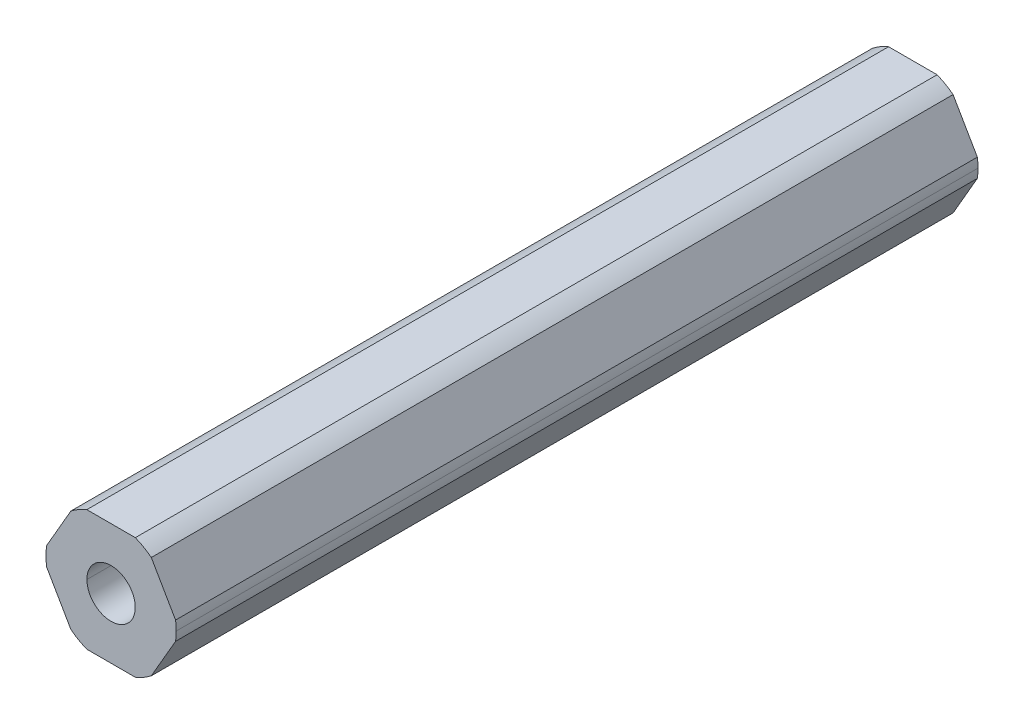
ISO-10303-21;
HEADER;
FILE_DESCRIPTION(('STEP AP214'),'2;1');
FILE_NAME('part.step','',(''),(''),'','','');
FILE_SCHEMA(('AUTOMOTIVE_DESIGN { 1 0 10303 214 1 1 1 1 }'));
ENDSEC;
DATA;
#1=APPLICATION_CONTEXT('core data for automotive mechanical design processes');
#2=APPLICATION_PROTOCOL_DEFINITION('international standard','automotive_design',2000,#1);
#3=PRODUCT_CONTEXT('',#1,'mechanical');
#4=PRODUCT('Part','Part','',(#3));
#5=PRODUCT_RELATED_PRODUCT_CATEGORY('part','',(#4));
#6=PRODUCT_DEFINITION_FORMATION('','',#4);
#7=PRODUCT_DEFINITION_CONTEXT('part definition',#1,'design');
#8=PRODUCT_DEFINITION('design','',#6,#7);
#9=PRODUCT_DEFINITION_SHAPE('','',#8);
#10=(LENGTH_UNIT() NAMED_UNIT(*) SI_UNIT(.MILLI.,.METRE.));
#11=(NAMED_UNIT(*) PLANE_ANGLE_UNIT() SI_UNIT($,.RADIAN.));
#12=(NAMED_UNIT(*) SI_UNIT($,.STERADIAN.) SOLID_ANGLE_UNIT());
#13=UNCERTAINTY_MEASURE_WITH_UNIT(LENGTH_MEASURE(1.E-05),#10,'distance_accuracy_value','');
#14=(GEOMETRIC_REPRESENTATION_CONTEXT(3) GLOBAL_UNCERTAINTY_ASSIGNED_CONTEXT((#13)) GLOBAL_UNIT_ASSIGNED_CONTEXT((#10,
#11,#12)) REPRESENTATION_CONTEXT('',''));
#15=CARTESIAN_POINT('',(0.,0.,0.));
#16=DIRECTION('',(0.,0.,1.));
#17=DIRECTION('',(1.,0.,0.));
#18=AXIS2_PLACEMENT_3D('',#15,#16,#17);
#19=CARTESIAN_POINT('',(0.,0.,-228.6));
#20=DIRECTION('',(0.,0.,1.));
#21=DIRECTION('',(1.,0.,0.));
#22=AXIS2_PLACEMENT_3D('',#19,#20,#21);
#23=CYLINDRICAL_SURFACE('',#22,2.55);
#24=CARTESIAN_POINT('',(0.,0.,-144.04975));
#25=DIRECTION('',(0.,0.,1.));
#26=DIRECTION('',(1.,0.,0.));
#27=AXIS2_PLACEMENT_3D('',#24,#25,#26);
#28=CIRCLE('',#27,2.55);
#29=CARTESIAN_POINT('',(2.55,0.,-144.04975));
#30=VERTEX_POINT('',#29);
#31=CARTESIAN_POINT('',(-2.55,0.,-144.04975));
#32=VERTEX_POINT('',#31);
#33=EDGE_CURVE('E59',#30,#32,#28,.F.);
#34=ORIENTED_EDGE('',*,*,#33,.F.);
#35=DIRECTION('',(0.,0.,1.));
#36=VECTOR('',#35,1.);
#37=CARTESIAN_POINT('',(2.55,0.,-228.6));
#38=LINE('',#37,#36);
#39=CARTESIAN_POINT('',(2.55,0.,-228.6));
#40=VERTEX_POINT('',#39);
#41=EDGE_CURVE('E239',#40,#30,#38,.T.);
#42=ORIENTED_EDGE('',*,*,#41,.F.);
#43=CARTESIAN_POINT('',(0.,0.,-228.6));
#44=DIRECTION('',(0.,0.,1.));
#45=DIRECTION('',(1.,0.,0.));
#46=AXIS2_PLACEMENT_3D('',#43,#44,#45);
#47=CIRCLE('',#46,2.55);
#48=CARTESIAN_POINT('',(-2.55,0.,-228.6));
#49=VERTEX_POINT('',#48);
#50=EDGE_CURVE('E185',#49,#40,#47,.T.);
#51=ORIENTED_EDGE('',*,*,#50,.F.);
#52=DIRECTION('',(0.,0.,1.));
#53=VECTOR('',#52,1.);
#54=CARTESIAN_POINT('',(-2.55,0.,-228.6));
#55=LINE('',#54,#53);
#56=EDGE_CURVE('E46',#49,#32,#55,.T.);
#57=ORIENTED_EDGE('',*,*,#56,.T.);
#58=EDGE_LOOP('',(#34,#42,#51,#57));
#59=FACE_BOUND('',#58,.T.);
#60=ADVANCED_FACE('F38',(#59),#23,.F.);
#61=CARTESIAN_POINT('',(0.,0.,-228.6));
#62=DIRECTION('',(0.,0.,1.));
#63=DIRECTION('',(1.,0.,0.));
#64=AXIS2_PLACEMENT_3D('',#61,#62,#63);
#65=CYLINDRICAL_SURFACE('',#64,6.87);
#66=DIRECTION('',(0.,0.,1.));
#67=VECTOR('',#66,1.);
#68=CARTESIAN_POINT('',(6.87,0.,-228.6));
#69=LINE('',#68,#67);
#70=CARTESIAN_POINT('',(6.87,0.,-228.6));
#71=VERTEX_POINT('',#70);
#72=CARTESIAN_POINT('',(6.87,0.,-144.04975));
#73=VERTEX_POINT('',#72);
#74=EDGE_CURVE('E237',#71,#73,#69,.T.);
#75=ORIENTED_EDGE('',*,*,#74,.T.);
#76=CARTESIAN_POINT('',(0.,0.,-144.04975));
#77=DIRECTION('',(0.,0.,1.));
#78=DIRECTION('',(1.,0.,0.));
#79=AXIS2_PLACEMENT_3D('',#76,#77,#78);
#80=CIRCLE('',#79,6.87);
#81=CARTESIAN_POINT('',(6.80102150534208,-0.971085209378955,-144.04975));
#82=VERTEX_POINT('',#81);
#83=EDGE_CURVE('E160',#82,#73,#80,.T.);
#84=ORIENTED_EDGE('',*,*,#83,.F.);
#85=DIRECTION('',(0.,0.,-1.));
#86=VECTOR('',#85,1.);
#87=CARTESIAN_POINT('',(6.80102150534208,-0.971085209378962,-228.6));
#88=LINE('',#87,#86);
#89=CARTESIAN_POINT('',(6.80102150534208,-0.971085209378955,-228.6));
#90=VERTEX_POINT('',#89);
#91=EDGE_CURVE('E235',#82,#90,#88,.T.);
#92=ORIENTED_EDGE('',*,*,#91,.T.);
#93=CARTESIAN_POINT('',(0.,0.,-228.6));
#94=DIRECTION('',(0.,0.,1.));
#95=DIRECTION('',(1.,0.,0.));
#96=AXIS2_PLACEMENT_3D('',#93,#94,#95);
#97=CIRCLE('',#96,6.87);
#98=EDGE_CURVE('E201',#90,#71,#97,.T.);
#99=ORIENTED_EDGE('',*,*,#98,.T.);
#100=EDGE_LOOP('',(#75,#84,#92,#99));
#101=FACE_BOUND('',#100,.T.);
#102=ADVANCED_FACE('F362',(#101),#65,.T.);
#103=CARTESIAN_POINT('',(3.68083890619154,-6.3754,228.6));
#104=DIRECTION('',(-0.866025403784439,0.5,0.));
#105=DIRECTION('',(0.,0.,1.));
#106=AXIS2_PLACEMENT_3D('',#103,#104,#105);
#107=PLANE('',#106);
#108=DIRECTION('',(0.500000000000001,0.866025403784438,0.));
#109=VECTOR('',#108,1.);
#110=CARTESIAN_POINT('',(4.24149521323254,-5.40431479062105,-144.04975));
#111=LINE('',#110,#109);
#112=CARTESIAN_POINT('',(4.24149521323254,-5.40431479062105,-144.04975));
#113=VERTEX_POINT('',#112);
#114=EDGE_CURVE('E305',#113,#82,#111,.T.);
#115=ORIENTED_EDGE('',*,*,#114,.F.);
#116=DIRECTION('',(0.,0.,1.));
#117=VECTOR('',#116,1.);
#118=CARTESIAN_POINT('',(4.24149521323255,-5.40431479062104,-228.6));
#119=LINE('',#118,#117);
#120=CARTESIAN_POINT('',(4.24149521323254,-5.40431479062105,-228.6));
#121=VERTEX_POINT('',#120);
#122=EDGE_CURVE('E179',#121,#113,#119,.T.);
#123=ORIENTED_EDGE('',*,*,#122,.F.);
#124=DIRECTION('',(0.5,0.866025403784439,0.));
#125=VECTOR('',#124,1.);
#126=CARTESIAN_POINT('',(3.68083890619154,-6.3754,-228.6));
#127=LINE('',#126,#125);
#128=EDGE_CURVE('E238',#121,#90,#127,.T.);
#129=ORIENTED_EDGE('',*,*,#128,.T.);
#130=ORIENTED_EDGE('',*,*,#91,.F.);
#131=EDGE_LOOP('',(#115,#123,#129,#130));
#132=FACE_BOUND('',#131,.T.);
#133=ADVANCED_FACE('F332',(#132),#107,.F.);
#134=CARTESIAN_POINT('',(7.36167781238308,0.,228.6));
#135=DIRECTION('',(-0.866025403784439,-0.5,0.));
#136=DIRECTION('',(-0.5,0.866025403784439,0.));
#137=AXIS2_PLACEMENT_3D('',#134,#135,#136);
#138=PLANE('',#137);
#139=DIRECTION('',(-0.5,0.866025403784438,0.));
#140=VECTOR('',#139,1.);
#141=CARTESIAN_POINT('',(6.80102150534208,0.97108520937895,-144.04975));
#142=LINE('',#141,#140);
#143=CARTESIAN_POINT('',(6.80102150534208,0.97108520937895,-144.04975));
#144=VERTEX_POINT('',#143);
#145=CARTESIAN_POINT('',(4.24149521323254,5.40431479062105,-144.04975));
#146=VERTEX_POINT('',#145);
#147=EDGE_CURVE('E53',#144,#146,#142,.T.);
#148=ORIENTED_EDGE('',*,*,#147,.F.);
#149=DIRECTION('',(0.,0.,1.));
#150=VECTOR('',#149,1.);
#151=CARTESIAN_POINT('',(6.80102150534208,0.971085209378949,-228.6));
#152=LINE('',#151,#150);
#153=CARTESIAN_POINT('',(6.80102150534208,0.97108520937895,-228.6));
#154=VERTEX_POINT('',#153);
#155=EDGE_CURVE('E169',#154,#144,#152,.T.);
#156=ORIENTED_EDGE('',*,*,#155,.F.);
#157=DIRECTION('',(-0.5,0.866025403784439,0.));
#158=VECTOR('',#157,1.);
#159=CARTESIAN_POINT('',(7.36167781238308,0.,-228.6));
#160=LINE('',#159,#158);
#161=CARTESIAN_POINT('',(4.24149521323254,5.40431479062105,-228.6));
#162=VERTEX_POINT('',#161);
#163=EDGE_CURVE('E206',#154,#162,#160,.T.);
#164=ORIENTED_EDGE('',*,*,#163,.T.);
#165=DIRECTION('',(0.,0.,-1.));
#166=VECTOR('',#165,1.);
#167=CARTESIAN_POINT('',(4.24149521323254,5.40431479062105,-228.6));
#168=LINE('',#167,#166);
#169=EDGE_CURVE('E171',#146,#162,#168,.T.);
#170=ORIENTED_EDGE('',*,*,#169,.F.);
#171=EDGE_LOOP('',(#148,#156,#164,#170));
#172=FACE_BOUND('',#171,.T.);
#173=ADVANCED_FACE('F167',(#172),#138,.F.);
#174=CARTESIAN_POINT('',(3.68083890619154,6.3754,228.6));
#175=DIRECTION('',(0.,-1.,0.));
#176=DIRECTION('',(0.,0.,-1.));
#177=AXIS2_PLACEMENT_3D('',#174,#175,#176);
#178=PLANE('',#177);
#179=DIRECTION('',(-1.,0.,0.));
#180=VECTOR('',#179,1.);
#181=CARTESIAN_POINT('',(2.55952629210953,6.3754,-144.04975));
#182=LINE('',#181,#180);
#183=CARTESIAN_POINT('',(2.55952629210953,6.3754,-144.04975));
#184=VERTEX_POINT('',#183);
#185=CARTESIAN_POINT('',(-2.55952629210953,6.3754,-144.04975));
#186=VERTEX_POINT('',#185);
#187=EDGE_CURVE('E319',#184,#186,#182,.T.);
#188=ORIENTED_EDGE('',*,*,#187,.F.);
#189=DIRECTION('',(0.,0.,1.));
#190=VECTOR('',#189,1.);
#191=CARTESIAN_POINT('',(2.55952629210952,6.3754,-228.6));
#192=LINE('',#191,#190);
#193=CARTESIAN_POINT('',(2.55952629210952,6.3754,-228.6));
#194=VERTEX_POINT('',#193);
#195=EDGE_CURVE('E243',#194,#184,#192,.T.);
#196=ORIENTED_EDGE('',*,*,#195,.F.);
#197=DIRECTION('',(-1.,0.,0.));
#198=VECTOR('',#197,1.);
#199=CARTESIAN_POINT('',(3.68083890619154,6.3754,-228.6));
#200=LINE('',#199,#198);
#201=CARTESIAN_POINT('',(-2.55952629210953,6.3754,-228.6));
#202=VERTEX_POINT('',#201);
#203=EDGE_CURVE('E202',#194,#202,#200,.T.);
#204=ORIENTED_EDGE('',*,*,#203,.T.);
#205=DIRECTION('',(0.,0.,-1.));
#206=VECTOR('',#205,1.);
#207=CARTESIAN_POINT('',(-2.55952629210953,6.3754,-228.6));
#208=LINE('',#207,#206);
#209=EDGE_CURVE('E230',#186,#202,#208,.T.);
#210=ORIENTED_EDGE('',*,*,#209,.F.);
#211=EDGE_LOOP('',(#188,#196,#204,#210));
#212=FACE_BOUND('',#211,.T.);
#213=ADVANCED_FACE('F323',(#212),#178,.F.);
#214=CARTESIAN_POINT('',(-3.68083890619154,6.3754,228.6));
#215=DIRECTION('',(0.866025403784439,-0.5,0.));
#216=DIRECTION('',(0.,0.,-1.));
#217=AXIS2_PLACEMENT_3D('',#214,#215,#216);
#218=PLANE('',#217);
#219=DIRECTION('',(-0.5,-0.866025403784438,0.));
#220=VECTOR('',#219,1.);
#221=CARTESIAN_POINT('',(-4.24149521323255,5.40431479062105,-144.04975));
#222=LINE('',#221,#220);
#223=CARTESIAN_POINT('',(-4.24149521323254,5.40431479062105,-144.04975));
#224=VERTEX_POINT('',#223);
#225=CARTESIAN_POINT('',(-6.80102150534208,0.97108520937896,-144.04975));
#226=VERTEX_POINT('',#225);
#227=EDGE_CURVE('E290',#224,#226,#222,.T.);
#228=ORIENTED_EDGE('',*,*,#227,.F.);
#229=DIRECTION('',(0.,0.,1.));
#230=VECTOR('',#229,1.);
#231=CARTESIAN_POINT('',(-4.24149521323255,5.40431479062105,-228.6));
#232=LINE('',#231,#230);
#233=CARTESIAN_POINT('',(-4.24149521323255,5.40431479062105,-228.6));
#234=VERTEX_POINT('',#233);
#235=EDGE_CURVE('E257',#234,#224,#232,.T.);
#236=ORIENTED_EDGE('',*,*,#235,.F.);
#237=DIRECTION('',(-0.5,-0.866025403784439,0.));
#238=VECTOR('',#237,1.);
#239=CARTESIAN_POINT('',(-3.68083890619154,6.3754,-228.6));
#240=LINE('',#239,#238);
#241=CARTESIAN_POINT('',(-6.80102150534208,0.97108520937896,-228.6));
#242=VERTEX_POINT('',#241);
#243=EDGE_CURVE('E207',#234,#242,#240,.T.);
#244=ORIENTED_EDGE('',*,*,#243,.T.);
#245=DIRECTION('',(0.,0.,-1.));
#246=VECTOR('',#245,1.);
#247=CARTESIAN_POINT('',(-6.80102150534208,0.97108520937896,-228.6));
#248=LINE('',#247,#246);
#249=EDGE_CURVE('E208',#226,#242,#248,.T.);
#250=ORIENTED_EDGE('',*,*,#249,.F.);
#251=EDGE_LOOP('',(#228,#236,#244,#250));
#252=FACE_BOUND('',#251,.T.);
#253=ADVANCED_FACE('F287',(#252),#218,.F.);
#254=CARTESIAN_POINT('',(-7.36167781238308,0.,228.6));
#255=DIRECTION('',(0.866025403784439,0.5,0.));
#256=DIRECTION('',(0.,0.,-1.));
#257=AXIS2_PLACEMENT_3D('',#254,#255,#256);
#258=PLANE('',#257);
#259=DIRECTION('',(0.5,-0.866025403784439,0.));
#260=VECTOR('',#259,1.);
#261=CARTESIAN_POINT('',(-6.80102150534208,-0.971085209378954,-144.04975));
#262=LINE('',#261,#260);
#263=CARTESIAN_POINT('',(-6.80102150534208,-0.971085209378951,-144.04975));
#264=VERTEX_POINT('',#263);
#265=CARTESIAN_POINT('',(-4.24149521323254,-5.40431479062105,-144.04975));
#266=VERTEX_POINT('',#265);
#267=EDGE_CURVE('E313',#264,#266,#262,.T.);
#268=ORIENTED_EDGE('',*,*,#267,.F.);
#269=DIRECTION('',(0.,0.,1.));
#270=VECTOR('',#269,1.);
#271=CARTESIAN_POINT('',(-6.80102150534208,-0.971085209378962,-228.6));
#272=LINE('',#271,#270);
#273=CARTESIAN_POINT('',(-6.80102150534208,-0.971085209378956,-228.6));
#274=VERTEX_POINT('',#273);
#275=EDGE_CURVE('E226',#274,#264,#272,.T.);
#276=ORIENTED_EDGE('',*,*,#275,.F.);
#277=DIRECTION('',(0.5,-0.866025403784439,0.));
#278=VECTOR('',#277,1.);
#279=CARTESIAN_POINT('',(-7.36167781238308,0.,-228.6));
#280=LINE('',#279,#278);
#281=CARTESIAN_POINT('',(-4.24149521323254,-5.40431479062105,-228.6));
#282=VERTEX_POINT('',#281);
#283=EDGE_CURVE('E221',#274,#282,#280,.T.);
#284=ORIENTED_EDGE('',*,*,#283,.T.);
#285=DIRECTION('',(0.,0.,-1.));
#286=VECTOR('',#285,1.);
#287=CARTESIAN_POINT('',(-4.24149521323255,-5.40431479062104,-228.6));
#288=LINE('',#287,#286);
#289=EDGE_CURVE('E216',#266,#282,#288,.T.);
#290=ORIENTED_EDGE('',*,*,#289,.F.);
#291=EDGE_LOOP('',(#268,#276,#284,#290));
#292=FACE_BOUND('',#291,.T.);
#293=ADVANCED_FACE('F346',(#292),#258,.F.);
#294=CARTESIAN_POINT('',(-3.68083890619154,-6.3754,228.6));
#295=DIRECTION('',(0.,1.,0.));
#296=DIRECTION('',(1.,0.,0.));
#297=AXIS2_PLACEMENT_3D('',#294,#295,#296);
#298=PLANE('',#297);
#299=DIRECTION('',(1.,0.,0.));
#300=VECTOR('',#299,1.);
#301=CARTESIAN_POINT('',(-2.55952629210953,-6.3754,-144.04975));
#302=LINE('',#301,#300);
#303=CARTESIAN_POINT('',(-2.55952629210953,-6.3754,-144.04975));
#304=VERTEX_POINT('',#303);
#305=CARTESIAN_POINT('',(2.55952629210953,-6.3754,-144.04975));
#306=VERTEX_POINT('',#305);
#307=EDGE_CURVE('E309',#304,#306,#302,.T.);
#308=ORIENTED_EDGE('',*,*,#307,.F.);
#309=DIRECTION('',(0.,0.,1.));
#310=VECTOR('',#309,1.);
#311=CARTESIAN_POINT('',(-2.55952629210953,-6.3754,-228.6));
#312=LINE('',#311,#310);
#313=CARTESIAN_POINT('',(-2.55952629210953,-6.3754,-228.6));
#314=VERTEX_POINT('',#313);
#315=EDGE_CURVE('E209',#314,#304,#312,.T.);
#316=ORIENTED_EDGE('',*,*,#315,.F.);
#317=DIRECTION('',(1.,0.,0.));
#318=VECTOR('',#317,1.);
#319=CARTESIAN_POINT('',(-3.68083890619154,-6.3754,-228.6));
#320=LINE('',#319,#318);
#321=CARTESIAN_POINT('',(2.55952629210953,-6.3754,-228.6));
#322=VERTEX_POINT('',#321);
#323=EDGE_CURVE('E217',#314,#322,#320,.T.);
#324=ORIENTED_EDGE('',*,*,#323,.T.);
#325=DIRECTION('',(0.,0.,-1.));
#326=VECTOR('',#325,1.);
#327=CARTESIAN_POINT('',(2.55952629210953,-6.3754,-228.6));
#328=LINE('',#327,#326);
#329=EDGE_CURVE('E189',#306,#322,#328,.T.);
#330=ORIENTED_EDGE('',*,*,#329,.F.);
#331=EDGE_LOOP('',(#308,#316,#324,#330));
#332=FACE_BOUND('',#331,.T.);
#333=ADVANCED_FACE('F350',(#332),#298,.F.);
#334=CARTESIAN_POINT('',(0.,0.,-228.6));
#335=DIRECTION('',(0.,0.,1.));
#336=DIRECTION('',(1.,0.,0.));
#337=AXIS2_PLACEMENT_3D('',#334,#335,#336);
#338=CYLINDRICAL_SURFACE('',#337,6.87);
#339=ORIENTED_EDGE('',*,*,#155,.T.);
#340=EDGE_CURVE('E157',#73,#144,#80,.T.);
#341=ORIENTED_EDGE('',*,*,#340,.F.);
#342=ORIENTED_EDGE('',*,*,#74,.F.);
#343=CARTESIAN_POINT('',(0.,0.,-228.6));
#344=DIRECTION('',(0.,0.,1.));
#345=DIRECTION('',(1.,0.,0.));
#346=AXIS2_PLACEMENT_3D('',#343,#344,#345);
#347=CIRCLE('',#346,6.87);
#348=EDGE_CURVE('E177',#71,#154,#347,.T.);
#349=ORIENTED_EDGE('',*,*,#348,.T.);
#350=EDGE_LOOP('',(#339,#341,#342,#349));
#351=FACE_BOUND('',#350,.T.);
#352=ADVANCED_FACE('F175',(#351),#338,.T.);
#353=CARTESIAN_POINT('',(0.,0.,-228.6));
#354=DIRECTION('',(0.,0.,1.));
#355=DIRECTION('',(1.,0.,0.));
#356=AXIS2_PLACEMENT_3D('',#353,#354,#355);
#357=CYLINDRICAL_SURFACE('',#356,6.87);
#358=ORIENTED_EDGE('',*,*,#122,.T.);
#359=CARTESIAN_POINT('',(0.,0.,-144.04975));
#360=DIRECTION('',(0.,0.,1.));
#361=DIRECTION('',(1.,0.,0.));
#362=AXIS2_PLACEMENT_3D('',#359,#360,#361);
#363=CIRCLE('',#362,6.87);
#364=EDGE_CURVE('E307',#306,#113,#363,.T.);
#365=ORIENTED_EDGE('',*,*,#364,.F.);
#366=ORIENTED_EDGE('',*,*,#329,.T.);
#367=CARTESIAN_POINT('',(0.,0.,-228.6));
#368=DIRECTION('',(0.,0.,1.));
#369=DIRECTION('',(1.,0.,0.));
#370=AXIS2_PLACEMENT_3D('',#367,#368,#369);
#371=CIRCLE('',#370,6.87);
#372=EDGE_CURVE('E193',#322,#121,#371,.T.);
#373=ORIENTED_EDGE('',*,*,#372,.T.);
#374=EDGE_LOOP('',(#358,#365,#366,#373));
#375=FACE_BOUND('',#374,.T.);
#376=ADVANCED_FACE('F335',(#375),#357,.T.);
#377=CARTESIAN_POINT('',(0.,0.,-228.6));
#378=DIRECTION('',(0.,0.,1.));
#379=DIRECTION('',(1.,0.,0.));
#380=AXIS2_PLACEMENT_3D('',#377,#378,#379);
#381=CYLINDRICAL_SURFACE('',#380,6.87);
#382=ORIENTED_EDGE('',*,*,#315,.T.);
#383=CARTESIAN_POINT('',(0.,0.,-144.04975));
#384=DIRECTION('',(0.,0.,1.));
#385=DIRECTION('',(1.,0.,0.));
#386=AXIS2_PLACEMENT_3D('',#383,#384,#385);
#387=CIRCLE('',#386,6.87);
#388=EDGE_CURVE('E311',#266,#304,#387,.T.);
#389=ORIENTED_EDGE('',*,*,#388,.F.);
#390=ORIENTED_EDGE('',*,*,#289,.T.);
#391=CARTESIAN_POINT('',(0.,0.,-228.6));
#392=DIRECTION('',(0.,0.,1.));
#393=DIRECTION('',(1.,0.,0.));
#394=AXIS2_PLACEMENT_3D('',#391,#392,#393);
#395=CIRCLE('',#394,6.87);
#396=EDGE_CURVE('E212',#282,#314,#395,.T.);
#397=ORIENTED_EDGE('',*,*,#396,.T.);
#398=EDGE_LOOP('',(#382,#389,#390,#397));
#399=FACE_BOUND('',#398,.T.);
#400=ADVANCED_FACE('F341',(#399),#381,.T.);
#401=CARTESIAN_POINT('',(0.,0.,-228.6));
#402=DIRECTION('',(0.,0.,1.));
#403=DIRECTION('',(1.,0.,0.));
#404=AXIS2_PLACEMENT_3D('',#401,#402,#403);
#405=CYLINDRICAL_SURFACE('',#404,6.87);
#406=ORIENTED_EDGE('',*,*,#275,.T.);
#407=CARTESIAN_POINT('',(0.,0.,-144.04975));
#408=DIRECTION('',(0.,0.,1.));
#409=DIRECTION('',(1.,0.,0.));
#410=AXIS2_PLACEMENT_3D('',#407,#408,#409);
#411=CIRCLE('',#410,6.87);
#412=EDGE_CURVE('E315',#226,#264,#411,.T.);
#413=ORIENTED_EDGE('',*,*,#412,.F.);
#414=ORIENTED_EDGE('',*,*,#249,.T.);
#415=CARTESIAN_POINT('',(0.,0.,-228.6));
#416=DIRECTION('',(0.,0.,1.));
#417=DIRECTION('',(1.,0.,0.));
#418=AXIS2_PLACEMENT_3D('',#415,#416,#417);
#419=CIRCLE('',#418,6.87);
#420=EDGE_CURVE('E210',#242,#274,#419,.T.);
#421=ORIENTED_EDGE('',*,*,#420,.T.);
#422=EDGE_LOOP('',(#406,#413,#414,#421));
#423=FACE_BOUND('',#422,.T.);
#424=ADVANCED_FACE('F348',(#423),#405,.T.);
#425=CARTESIAN_POINT('',(0.,0.,-228.6));
#426=DIRECTION('',(0.,0.,1.));
#427=DIRECTION('',(1.,0.,0.));
#428=AXIS2_PLACEMENT_3D('',#425,#426,#427);
#429=CYLINDRICAL_SURFACE('',#428,6.87);
#430=ORIENTED_EDGE('',*,*,#235,.T.);
#431=CARTESIAN_POINT('',(0.,0.,-144.04975));
#432=DIRECTION('',(0.,0.,1.));
#433=DIRECTION('',(1.,0.,0.));
#434=AXIS2_PLACEMENT_3D('',#431,#432,#433);
#435=CIRCLE('',#434,6.87);
#436=EDGE_CURVE('E281',#186,#224,#435,.T.);
#437=ORIENTED_EDGE('',*,*,#436,.F.);
#438=ORIENTED_EDGE('',*,*,#209,.T.);
#439=CARTESIAN_POINT('',(0.,0.,-228.6));
#440=DIRECTION('',(0.,0.,1.));
#441=DIRECTION('',(1.,0.,0.));
#442=AXIS2_PLACEMENT_3D('',#439,#440,#441);
#443=CIRCLE('',#442,6.87);
#444=EDGE_CURVE('E253',#202,#234,#443,.T.);
#445=ORIENTED_EDGE('',*,*,#444,.T.);
#446=EDGE_LOOP('',(#430,#437,#438,#445));
#447=FACE_BOUND('',#446,.T.);
#448=ADVANCED_FACE('F280',(#447),#429,.T.);
#449=CARTESIAN_POINT('',(0.,0.,-228.6));
#450=DIRECTION('',(0.,0.,1.));
#451=DIRECTION('',(1.,0.,0.));
#452=AXIS2_PLACEMENT_3D('',#449,#450,#451);
#453=CYLINDRICAL_SURFACE('',#452,6.87);
#454=ORIENTED_EDGE('',*,*,#195,.T.);
#455=CARTESIAN_POINT('',(0.,0.,-144.04975));
#456=DIRECTION('',(0.,0.,1.));
#457=DIRECTION('',(1.,0.,0.));
#458=AXIS2_PLACEMENT_3D('',#455,#456,#457);
#459=CIRCLE('',#458,6.87);
#460=EDGE_CURVE('E172',#146,#184,#459,.T.);
#461=ORIENTED_EDGE('',*,*,#460,.F.);
#462=ORIENTED_EDGE('',*,*,#169,.T.);
#463=CARTESIAN_POINT('',(0.,0.,-228.6));
#464=DIRECTION('',(0.,0.,1.));
#465=DIRECTION('',(1.,0.,0.));
#466=AXIS2_PLACEMENT_3D('',#463,#464,#465);
#467=CIRCLE('',#466,6.87);
#468=EDGE_CURVE('E259',#162,#194,#467,.T.);
#469=ORIENTED_EDGE('',*,*,#468,.T.);
#470=EDGE_LOOP('',(#454,#461,#462,#469));
#471=FACE_BOUND('',#470,.T.);
#472=ADVANCED_FACE('F374',(#471),#453,.T.);
#473=CARTESIAN_POINT('',(0.,0.,-228.6));
#474=DIRECTION('',(0.,0.,1.));
#475=DIRECTION('',(1.,0.,0.));
#476=AXIS2_PLACEMENT_3D('',#473,#474,#475);
#477=CYLINDRICAL_SURFACE('',#476,2.55);
#478=CARTESIAN_POINT('',(0.,0.,-144.04975));
#479=DIRECTION('',(0.,0.,1.));
#480=DIRECTION('',(1.,0.,0.));
#481=AXIS2_PLACEMENT_3D('',#478,#479,#480);
#482=CIRCLE('',#481,2.55);
#483=EDGE_CURVE('E11',#32,#30,#482,.F.);
#484=ORIENTED_EDGE('',*,*,#483,.F.);
#485=ORIENTED_EDGE('',*,*,#56,.F.);
#486=CARTESIAN_POINT('',(0.,0.,-228.6));
#487=DIRECTION('',(0.,0.,1.));
#488=DIRECTION('',(1.,0.,0.));
#489=AXIS2_PLACEMENT_3D('',#486,#487,#488);
#490=CIRCLE('',#489,2.55);
#491=EDGE_CURVE('E197',#40,#49,#490,.T.);
#492=ORIENTED_EDGE('',*,*,#491,.F.);
#493=ORIENTED_EDGE('',*,*,#41,.T.);
#494=EDGE_LOOP('',(#484,#485,#492,#493));
#495=FACE_BOUND('',#494,.T.);
#496=ADVANCED_FACE('F375',(#495),#477,.F.);
#497=CARTESIAN_POINT('',(0.,0.,-228.6));
#498=DIRECTION('',(0.,0.,1.));
#499=DIRECTION('',(1.,0.,0.));
#500=AXIS2_PLACEMENT_3D('',#497,#498,#499);
#501=PLANE('',#500);
#502=ORIENTED_EDGE('',*,*,#468,.F.);
#503=ORIENTED_EDGE('',*,*,#163,.F.);
#504=ORIENTED_EDGE('',*,*,#348,.F.);
#505=ORIENTED_EDGE('',*,*,#98,.F.);
#506=ORIENTED_EDGE('',*,*,#128,.F.);
#507=ORIENTED_EDGE('',*,*,#372,.F.);
#508=ORIENTED_EDGE('',*,*,#323,.F.);
#509=ORIENTED_EDGE('',*,*,#396,.F.);
#510=ORIENTED_EDGE('',*,*,#283,.F.);
#511=ORIENTED_EDGE('',*,*,#420,.F.);
#512=ORIENTED_EDGE('',*,*,#243,.F.);
#513=ORIENTED_EDGE('',*,*,#444,.F.);
#514=ORIENTED_EDGE('',*,*,#203,.F.);
#515=EDGE_LOOP('',(#502,#503,#504,#505,#506,#507,#508,#509,#510,#511,#512,#513,#514));
#516=FACE_BOUND('',#515,.T.);
#517=ORIENTED_EDGE('',*,*,#491,.T.);
#518=ORIENTED_EDGE('',*,*,#50,.T.);
#519=EDGE_LOOP('',(#517,#518));
#520=FACE_BOUND('',#519,.T.);
#521=ADVANCED_FACE('F40',(#516,#520),#501,.F.);
#522=CARTESIAN_POINT('',(0.,0.,-144.04975));
#523=DIRECTION('',(0.,0.,1.));
#524=DIRECTION('',(1.,0.,0.));
#525=AXIS2_PLACEMENT_3D('',#522,#523,#524);
#526=PLANE('',#525);
#527=ORIENTED_EDGE('',*,*,#83,.T.);
#528=ORIENTED_EDGE('',*,*,#340,.T.);
#529=ORIENTED_EDGE('',*,*,#147,.T.);
#530=ORIENTED_EDGE('',*,*,#460,.T.);
#531=ORIENTED_EDGE('',*,*,#187,.T.);
#532=ORIENTED_EDGE('',*,*,#436,.T.);
#533=ORIENTED_EDGE('',*,*,#227,.T.);
#534=ORIENTED_EDGE('',*,*,#412,.T.);
#535=ORIENTED_EDGE('',*,*,#267,.T.);
#536=ORIENTED_EDGE('',*,*,#388,.T.);
#537=ORIENTED_EDGE('',*,*,#307,.T.);
#538=ORIENTED_EDGE('',*,*,#364,.T.);
#539=ORIENTED_EDGE('',*,*,#114,.T.);
#540=EDGE_LOOP('',(#527,#528,#529,#530,#531,#532,#533,#534,#535,#536,#537,#538,#539));
#541=FACE_BOUND('',#540,.T.);
#542=ORIENTED_EDGE('',*,*,#33,.T.);
#543=ORIENTED_EDGE('',*,*,#483,.T.);
#544=EDGE_LOOP('',(#542,#543));
#545=FACE_BOUND('',#544,.T.);
#546=ADVANCED_FACE('F158',(#541,#545),#526,.T.);
#547=CLOSED_SHELL('',(#60,#102,#133,#173,#213,#253,#293,#333,#352,#376,#400,#424,#448,#472,#496,
#521,#546));
#548=MANIFOLD_SOLID_BREP('B2',#547);
#549=ADVANCED_BREP_SHAPE_REPRESENTATION('',(#18,#548),#14);
#550=SHAPE_DEFINITION_REPRESENTATION(#9,#549);
ENDSEC;
END-ISO-10303-21;
